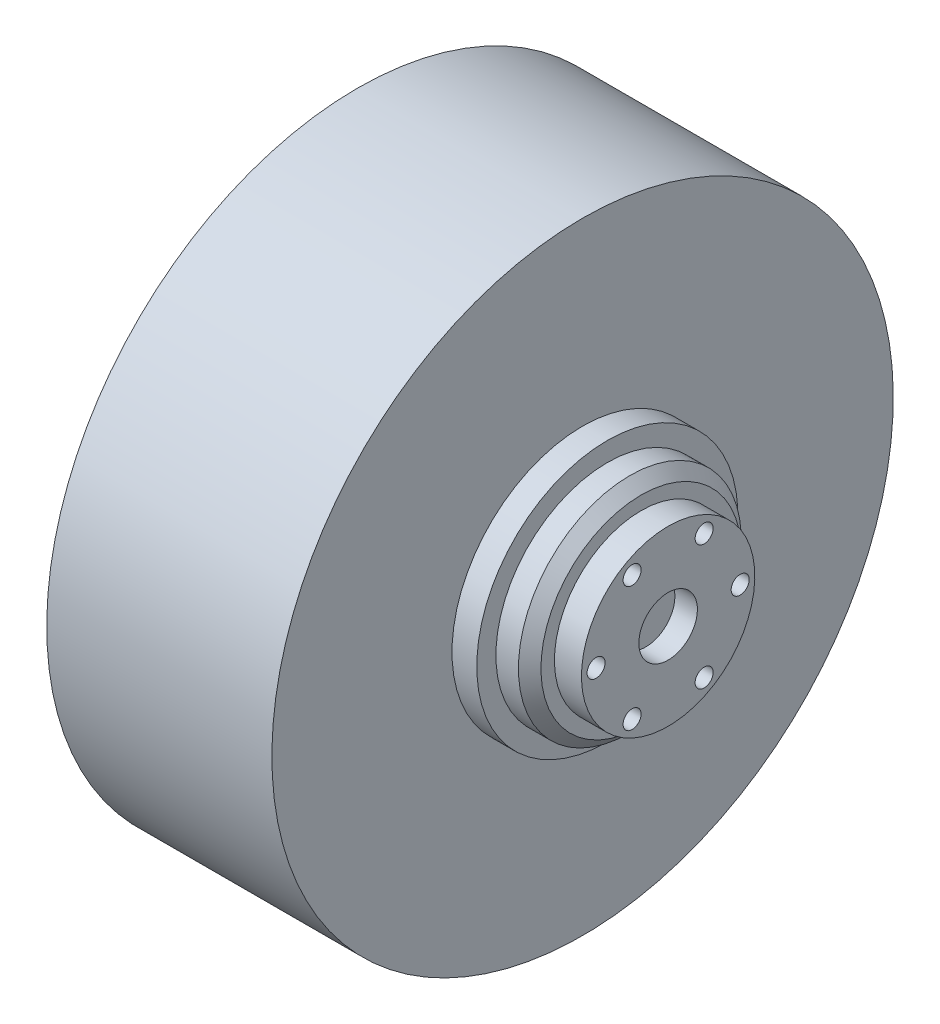
ISO-10303-21;
HEADER;
FILE_DESCRIPTION(('STEP AP214'),'2;1');
FILE_NAME('part.step','',(''),(''),'','','');
FILE_SCHEMA(('AUTOMOTIVE_DESIGN { 1 0 10303 214 1 1 1 1 }'));
ENDSEC;
DATA;
#1=APPLICATION_CONTEXT('core data for automotive mechanical design processes');
#2=APPLICATION_PROTOCOL_DEFINITION('international standard','automotive_design',2000,#1);
#3=PRODUCT_CONTEXT('',#1,'mechanical');
#4=PRODUCT('Part','Part','',(#3));
#5=PRODUCT_RELATED_PRODUCT_CATEGORY('part','',(#4));
#6=PRODUCT_DEFINITION_FORMATION('','',#4);
#7=PRODUCT_DEFINITION_CONTEXT('part definition',#1,'design');
#8=PRODUCT_DEFINITION('design','',#6,#7);
#9=PRODUCT_DEFINITION_SHAPE('','',#8);
#10=(LENGTH_UNIT() NAMED_UNIT(*) SI_UNIT(.MILLI.,.METRE.));
#11=(NAMED_UNIT(*) PLANE_ANGLE_UNIT() SI_UNIT($,.RADIAN.));
#12=(NAMED_UNIT(*) SI_UNIT($,.STERADIAN.) SOLID_ANGLE_UNIT());
#13=UNCERTAINTY_MEASURE_WITH_UNIT(LENGTH_MEASURE(1.E-05),#10,'distance_accuracy_value','');
#14=(GEOMETRIC_REPRESENTATION_CONTEXT(3) GLOBAL_UNCERTAINTY_ASSIGNED_CONTEXT((#13)) GLOBAL_UNIT_ASSIGNED_CONTEXT((#10,
#11,#12)) REPRESENTATION_CONTEXT('',''));
#15=CARTESIAN_POINT('',(0.,0.,0.));
#16=DIRECTION('',(0.,0.,1.));
#17=DIRECTION('',(1.,0.,0.));
#18=AXIS2_PLACEMENT_3D('',#15,#16,#17);
#19=CARTESIAN_POINT('',(-90.,0.,0.));
#20=DIRECTION('',(1.,0.,0.));
#21=DIRECTION('',(0.,1.,0.));
#22=AXIS2_PLACEMENT_3D('',#19,#20,#21);
#23=PLANE('',#22);
#24=CARTESIAN_POINT('',(-90.,0.,0.));
#25=DIRECTION('',(1.,0.,0.));
#26=DIRECTION('',(0.,1.,0.));
#27=AXIS2_PLACEMENT_3D('',#24,#25,#26);
#28=CIRCLE('',#27,36.5);
#29=CARTESIAN_POINT('',(-90.,36.5,0.));
#30=VERTEX_POINT('',#29);
#31=EDGE_CURVE('E10',#30,#30,#28,.T.);
#32=ORIENTED_EDGE('',*,*,#31,.F.);
#33=EDGE_LOOP('',(#32));
#34=FACE_BOUND('',#33,.T.);
#35=ADVANCED_FACE('F43',(#34),#23,.F.);
#36=CARTESIAN_POINT('',(90.,0.,0.));
#37=DIRECTION('',(1.,0.,0.));
#38=DIRECTION('',(0.,1.,0.));
#39=AXIS2_PLACEMENT_3D('',#36,#37,#38);
#40=CYLINDRICAL_SURFACE('',#39,36.5);
#41=CARTESIAN_POINT('',(-70.,0.,0.));
#42=DIRECTION('',(1.,0.,0.));
#43=DIRECTION('',(0.,1.,0.));
#44=AXIS2_PLACEMENT_3D('',#41,#42,#43);
#45=CIRCLE('',#44,36.5);
#46=CARTESIAN_POINT('',(-70.,36.5,0.));
#47=VERTEX_POINT('',#46);
#48=EDGE_CURVE('E50',#47,#47,#45,.T.);
#49=ORIENTED_EDGE('',*,*,#48,.F.);
#50=EDGE_LOOP('',(#49));
#51=FACE_BOUND('',#50,.T.);
#52=ORIENTED_EDGE('',*,*,#31,.T.);
#53=EDGE_LOOP('',(#52));
#54=FACE_BOUND('',#53,.T.);
#55=ADVANCED_FACE('F248',(#51,#54),#40,.T.);
#56=CARTESIAN_POINT('',(-70.,-36.5,0.));
#57=DIRECTION('',(1.,0.,0.));
#58=DIRECTION('',(0.,1.,0.));
#59=AXIS2_PLACEMENT_3D('',#56,#57,#58);
#60=PLANE('',#59);
#61=CARTESIAN_POINT('',(-70.,0.,0.));
#62=DIRECTION('',(1.,0.,0.));
#63=DIRECTION('',(0.,1.,0.));
#64=AXIS2_PLACEMENT_3D('',#61,#62,#63);
#65=CIRCLE('',#64,47.);
#66=CARTESIAN_POINT('',(-70.,47.,0.));
#67=VERTEX_POINT('',#66);
#68=EDGE_CURVE('E57',#67,#67,#65,.T.);
#69=ORIENTED_EDGE('',*,*,#68,.F.);
#70=EDGE_LOOP('',(#69));
#71=FACE_BOUND('',#70,.T.);
#72=ORIENTED_EDGE('',*,*,#48,.T.);
#73=EDGE_LOOP('',(#72));
#74=FACE_BOUND('',#73,.T.);
#75=ADVANCED_FACE('F243',(#71,#74),#60,.F.);
#76=CARTESIAN_POINT('',(90.,0.,0.));
#77=DIRECTION('',(1.,0.,0.));
#78=DIRECTION('',(0.,1.,0.));
#79=AXIS2_PLACEMENT_3D('',#76,#77,#78);
#80=CYLINDRICAL_SURFACE('',#79,47.);
#81=CARTESIAN_POINT('',(-48.,0.,0.));
#82=DIRECTION('',(1.,0.,0.));
#83=DIRECTION('',(0.,1.,0.));
#84=AXIS2_PLACEMENT_3D('',#81,#82,#83);
#85=CIRCLE('',#84,47.);
#86=CARTESIAN_POINT('',(-48.,47.,0.));
#87=VERTEX_POINT('',#86);
#88=EDGE_CURVE('E62',#87,#87,#85,.T.);
#89=ORIENTED_EDGE('',*,*,#88,.F.);
#90=EDGE_LOOP('',(#89));
#91=FACE_BOUND('',#90,.T.);
#92=ORIENTED_EDGE('',*,*,#68,.T.);
#93=EDGE_LOOP('',(#92));
#94=FACE_BOUND('',#93,.T.);
#95=ADVANCED_FACE('F237',(#91,#94),#80,.T.);
#96=CARTESIAN_POINT('',(-48.,-47.,0.));
#97=DIRECTION('',(1.,0.,0.));
#98=DIRECTION('',(0.,1.,0.));
#99=AXIS2_PLACEMENT_3D('',#96,#97,#98);
#100=PLANE('',#99);
#101=CARTESIAN_POINT('',(-48.,0.,0.));
#102=DIRECTION('',(1.,0.,0.));
#103=DIRECTION('',(0.,1.,0.));
#104=AXIS2_PLACEMENT_3D('',#101,#102,#103);
#105=CIRCLE('',#104,138.);
#106=CARTESIAN_POINT('',(-48.,138.,0.));
#107=VERTEX_POINT('',#106);
#108=EDGE_CURVE('E67',#107,#107,#105,.T.);
#109=ORIENTED_EDGE('',*,*,#108,.F.);
#110=EDGE_LOOP('',(#109));
#111=FACE_BOUND('',#110,.T.);
#112=ORIENTED_EDGE('',*,*,#88,.T.);
#113=EDGE_LOOP('',(#112));
#114=FACE_BOUND('',#113,.T.);
#115=ADVANCED_FACE('F231',(#111,#114),#100,.F.);
#116=CARTESIAN_POINT('',(90.,0.,0.));
#117=DIRECTION('',(1.,0.,0.));
#118=DIRECTION('',(0.,1.,0.));
#119=AXIS2_PLACEMENT_3D('',#116,#117,#118);
#120=CYLINDRICAL_SURFACE('',#119,138.);
#121=CARTESIAN_POINT('',(52.,0.,0.));
#122=DIRECTION('',(1.,0.,0.));
#123=DIRECTION('',(0.,1.,0.));
#124=AXIS2_PLACEMENT_3D('',#121,#122,#123);
#125=CIRCLE('',#124,138.);
#126=CARTESIAN_POINT('',(52.,138.,0.));
#127=VERTEX_POINT('',#126);
#128=EDGE_CURVE('E71',#127,#127,#125,.T.);
#129=ORIENTED_EDGE('',*,*,#128,.F.);
#130=EDGE_LOOP('',(#129));
#131=FACE_BOUND('',#130,.T.);
#132=ORIENTED_EDGE('',*,*,#108,.T.);
#133=EDGE_LOOP('',(#132));
#134=FACE_BOUND('',#133,.T.);
#135=ADVANCED_FACE('F225',(#131,#134),#120,.T.);
#136=CARTESIAN_POINT('',(52.,-138.,0.));
#137=DIRECTION('',(-1.,0.,0.));
#138=DIRECTION('',(0.,-1.,0.));
#139=AXIS2_PLACEMENT_3D('',#136,#137,#138);
#140=PLANE('',#139);
#141=CARTESIAN_POINT('',(52.,0.,0.));
#142=DIRECTION('',(1.,0.,0.));
#143=DIRECTION('',(0.,1.,0.));
#144=AXIS2_PLACEMENT_3D('',#141,#142,#143);
#145=CIRCLE('',#144,58.);
#146=CARTESIAN_POINT('',(52.,58.,0.));
#147=VERTEX_POINT('',#146);
#148=EDGE_CURVE('E74',#147,#147,#145,.T.);
#149=ORIENTED_EDGE('',*,*,#148,.F.);
#150=EDGE_LOOP('',(#149));
#151=FACE_BOUND('',#150,.T.);
#152=ORIENTED_EDGE('',*,*,#128,.T.);
#153=EDGE_LOOP('',(#152));
#154=FACE_BOUND('',#153,.T.);
#155=ADVANCED_FACE('F219',(#151,#154),#140,.F.);
#156=CARTESIAN_POINT('',(90.,0.,0.));
#157=DIRECTION('',(1.,0.,0.));
#158=DIRECTION('',(0.,1.,0.));
#159=AXIS2_PLACEMENT_3D('',#156,#157,#158);
#160=CYLINDRICAL_SURFACE('',#159,58.);
#161=CARTESIAN_POINT('',(63.,0.,0.));
#162=DIRECTION('',(1.,0.,0.));
#163=DIRECTION('',(0.,1.,0.));
#164=AXIS2_PLACEMENT_3D('',#161,#162,#163);
#165=CIRCLE('',#164,58.);
#166=CARTESIAN_POINT('',(63.,58.,0.));
#167=VERTEX_POINT('',#166);
#168=EDGE_CURVE('E78',#167,#167,#165,.T.);
#169=ORIENTED_EDGE('',*,*,#168,.F.);
#170=EDGE_LOOP('',(#169));
#171=FACE_BOUND('',#170,.T.);
#172=ORIENTED_EDGE('',*,*,#148,.T.);
#173=EDGE_LOOP('',(#172));
#174=FACE_BOUND('',#173,.T.);
#175=ADVANCED_FACE('F213',(#171,#174),#160,.T.);
#176=CARTESIAN_POINT('',(63.,-58.,0.));
#177=DIRECTION('',(-1.,0.,0.));
#178=DIRECTION('',(0.,-1.,0.));
#179=AXIS2_PLACEMENT_3D('',#176,#177,#178);
#180=PLANE('',#179);
#181=CARTESIAN_POINT('',(63.,0.,0.));
#182=DIRECTION('',(1.,0.,0.));
#183=DIRECTION('',(0.,1.,0.));
#184=AXIS2_PLACEMENT_3D('',#181,#182,#183);
#185=CIRCLE('',#184,49.5);
#186=CARTESIAN_POINT('',(63.,49.5,0.));
#187=VERTEX_POINT('',#186);
#188=EDGE_CURVE('E82',#187,#187,#185,.T.);
#189=ORIENTED_EDGE('',*,*,#188,.F.);
#190=EDGE_LOOP('',(#189));
#191=FACE_BOUND('',#190,.T.);
#192=ORIENTED_EDGE('',*,*,#168,.T.);
#193=EDGE_LOOP('',(#192));
#194=FACE_BOUND('',#193,.T.);
#195=ADVANCED_FACE('F207',(#191,#194),#180,.F.);
#196=CARTESIAN_POINT('',(90.,0.,0.));
#197=DIRECTION('',(1.,0.,0.));
#198=DIRECTION('',(0.,1.,0.));
#199=AXIS2_PLACEMENT_3D('',#196,#197,#198);
#200=CYLINDRICAL_SURFACE('',#199,49.5);
#201=CARTESIAN_POINT('',(73.,0.,0.));
#202=DIRECTION('',(1.,0.,0.));
#203=DIRECTION('',(0.,1.,0.));
#204=AXIS2_PLACEMENT_3D('',#201,#202,#203);
#205=CIRCLE('',#204,49.5);
#206=CARTESIAN_POINT('',(73.,49.5,0.));
#207=VERTEX_POINT('',#206);
#208=EDGE_CURVE('E86',#207,#207,#205,.T.);
#209=ORIENTED_EDGE('',*,*,#208,.F.);
#210=EDGE_LOOP('',(#209));
#211=FACE_BOUND('',#210,.T.);
#212=ORIENTED_EDGE('',*,*,#188,.T.);
#213=EDGE_LOOP('',(#212));
#214=FACE_BOUND('',#213,.T.);
#215=ADVANCED_FACE('F201',(#211,#214),#200,.T.);
#216=CARTESIAN_POINT('',(73.,0.,0.));
#217=DIRECTION('',(-1.,0.,0.));
#218=DIRECTION('',(0.,-1.,0.));
#219=AXIS2_PLACEMENT_3D('',#216,#217,#218);
#220=CONICAL_SURFACE('',#219,49.5,0.785398163397448);
#221=CARTESIAN_POINT('',(78.,0.,0.));
#222=DIRECTION('',(1.,0.,0.));
#223=DIRECTION('',(0.,1.,0.));
#224=AXIS2_PLACEMENT_3D('',#221,#222,#223);
#225=CIRCLE('',#224,44.5);
#226=CARTESIAN_POINT('',(78.,44.5,0.));
#227=VERTEX_POINT('',#226);
#228=EDGE_CURVE('E90',#227,#227,#225,.T.);
#229=ORIENTED_EDGE('',*,*,#228,.F.);
#230=EDGE_LOOP('',(#229));
#231=FACE_BOUND('',#230,.T.);
#232=ORIENTED_EDGE('',*,*,#208,.T.);
#233=EDGE_LOOP('',(#232));
#234=FACE_BOUND('',#233,.T.);
#235=ADVANCED_FACE('F195',(#231,#234),#220,.T.);
#236=CARTESIAN_POINT('',(78.,-44.5,0.));
#237=DIRECTION('',(-1.,0.,0.));
#238=DIRECTION('',(0.,-1.,0.));
#239=AXIS2_PLACEMENT_3D('',#236,#237,#238);
#240=PLANE('',#239);
#241=CARTESIAN_POINT('',(78.,0.,0.));
#242=DIRECTION('',(1.,0.,0.));
#243=DIRECTION('',(0.,1.,0.));
#244=AXIS2_PLACEMENT_3D('',#241,#242,#243);
#245=CIRCLE('',#244,38.5);
#246=CARTESIAN_POINT('',(78.,38.5,0.));
#247=VERTEX_POINT('',#246);
#248=EDGE_CURVE('E94',#247,#247,#245,.T.);
#249=ORIENTED_EDGE('',*,*,#248,.F.);
#250=EDGE_LOOP('',(#249));
#251=FACE_BOUND('',#250,.T.);
#252=ORIENTED_EDGE('',*,*,#228,.T.);
#253=EDGE_LOOP('',(#252));
#254=FACE_BOUND('',#253,.T.);
#255=ADVANCED_FACE('F189',(#251,#254),#240,.F.);
#256=CARTESIAN_POINT('',(90.,0.,0.));
#257=DIRECTION('',(1.,0.,0.));
#258=DIRECTION('',(0.,1.,0.));
#259=AXIS2_PLACEMENT_3D('',#256,#257,#258);
#260=CYLINDRICAL_SURFACE('',#259,38.5);
#261=CARTESIAN_POINT('',(90.,0.,0.));
#262=DIRECTION('',(1.,0.,0.));
#263=DIRECTION('',(0.,1.,0.));
#264=AXIS2_PLACEMENT_3D('',#261,#262,#263);
#265=CIRCLE('',#264,38.5);
#266=CARTESIAN_POINT('',(90.,38.5,0.));
#267=VERTEX_POINT('',#266);
#268=EDGE_CURVE('E98',#267,#267,#265,.T.);
#269=ORIENTED_EDGE('',*,*,#268,.F.);
#270=EDGE_LOOP('',(#269));
#271=FACE_BOUND('',#270,.T.);
#272=ORIENTED_EDGE('',*,*,#248,.T.);
#273=EDGE_LOOP('',(#272));
#274=FACE_BOUND('',#273,.T.);
#275=ADVANCED_FACE('F171',(#271,#274),#260,.T.);
#276=CARTESIAN_POINT('',(90.,-38.5,0.));
#277=DIRECTION('',(-1.,0.,0.));
#278=DIRECTION('',(0.,-1.,0.));
#279=AXIS2_PLACEMENT_3D('',#276,#277,#278);
#280=PLANE('',#279);
#281=CARTESIAN_POINT('',(90.,0.,0.));
#282=DIRECTION('',(1.,0.,0.));
#283=DIRECTION('',(0.,1.,0.));
#284=AXIS2_PLACEMENT_3D('',#281,#282,#283);
#285=CIRCLE('',#284,13.);
#286=CARTESIAN_POINT('',(90.,13.,0.));
#287=VERTEX_POINT('',#286);
#288=EDGE_CURVE('E150',#287,#287,#285,.T.);
#289=ORIENTED_EDGE('',*,*,#288,.F.);
#290=EDGE_LOOP('',(#289));
#291=FACE_BOUND('',#290,.T.);
#292=CARTESIAN_POINT('',(90.,27.712812921102,16.));
#293=DIRECTION('',(1.,0.,0.));
#294=DIRECTION('',(0.,1.,0.));
#295=AXIS2_PLACEMENT_3D('',#292,#293,#294);
#296=CIRCLE('',#295,4.);
#297=CARTESIAN_POINT('',(90.,31.712812921102,16.));
#298=VERTEX_POINT('',#297);
#299=EDGE_CURVE('E111',#298,#298,#296,.T.);
#300=ORIENTED_EDGE('',*,*,#299,.F.);
#301=EDGE_LOOP('',(#300));
#302=FACE_BOUND('',#301,.T.);
#303=CARTESIAN_POINT('',(90.,0.,32.));
#304=DIRECTION('',(1.,0.,0.));
#305=DIRECTION('',(0.,1.,0.));
#306=AXIS2_PLACEMENT_3D('',#303,#304,#305);
#307=CIRCLE('',#306,4.);
#308=CARTESIAN_POINT('',(90.,4.00000000000002,32.));
#309=VERTEX_POINT('',#308);
#310=EDGE_CURVE('E120',#309,#309,#307,.T.);
#311=ORIENTED_EDGE('',*,*,#310,.F.);
#312=EDGE_LOOP('',(#311));
#313=FACE_BOUND('',#312,.T.);
#314=CARTESIAN_POINT('',(90.,-27.712812921102,16.));
#315=DIRECTION('',(1.,0.,0.));
#316=DIRECTION('',(0.,1.,0.));
#317=AXIS2_PLACEMENT_3D('',#314,#315,#316);
#318=CIRCLE('',#317,4.);
#319=CARTESIAN_POINT('',(90.,-23.712812921102,16.));
#320=VERTEX_POINT('',#319);
#321=EDGE_CURVE('E128',#320,#320,#318,.T.);
#322=ORIENTED_EDGE('',*,*,#321,.F.);
#323=EDGE_LOOP('',(#322));
#324=FACE_BOUND('',#323,.T.);
#325=CARTESIAN_POINT('',(90.,-27.712812921102,-16.));
#326=DIRECTION('',(1.,0.,0.));
#327=DIRECTION('',(0.,1.,0.));
#328=AXIS2_PLACEMENT_3D('',#325,#326,#327);
#329=CIRCLE('',#328,4.);
#330=CARTESIAN_POINT('',(90.,-23.712812921102,-16.));
#331=VERTEX_POINT('',#330);
#332=EDGE_CURVE('E136',#331,#331,#329,.T.);
#333=ORIENTED_EDGE('',*,*,#332,.F.);
#334=EDGE_LOOP('',(#333));
#335=FACE_BOUND('',#334,.T.);
#336=CARTESIAN_POINT('',(90.,0.,-32.));
#337=DIRECTION('',(1.,0.,0.));
#338=DIRECTION('',(0.,1.,0.));
#339=AXIS2_PLACEMENT_3D('',#336,#337,#338);
#340=CIRCLE('',#339,4.);
#341=CARTESIAN_POINT('',(90.,4.00000000000001,-32.));
#342=VERTEX_POINT('',#341);
#343=EDGE_CURVE('E143',#342,#342,#340,.T.);
#344=ORIENTED_EDGE('',*,*,#343,.F.);
#345=EDGE_LOOP('',(#344));
#346=FACE_BOUND('',#345,.T.);
#347=CARTESIAN_POINT('',(90.,27.712812921102,-16.));
#348=DIRECTION('',(1.,0.,0.));
#349=DIRECTION('',(0.,1.,0.));
#350=AXIS2_PLACEMENT_3D('',#347,#348,#349);
#351=CIRCLE('',#350,4.);
#352=CARTESIAN_POINT('',(90.,31.712812921102,-16.));
#353=VERTEX_POINT('',#352);
#354=EDGE_CURVE('E103',#353,#353,#351,.T.);
#355=ORIENTED_EDGE('',*,*,#354,.F.);
#356=EDGE_LOOP('',(#355));
#357=FACE_BOUND('',#356,.T.);
#358=ORIENTED_EDGE('',*,*,#268,.T.);
#359=EDGE_LOOP('',(#358));
#360=FACE_BOUND('',#359,.T.);
#361=ADVANCED_FACE('F167',(#291,#302,#313,#324,#335,#346,#357,#360),#280,.F.);
#362=CARTESIAN_POINT('',(80.,27.712812921102,-16.));
#363=DIRECTION('',(1.,0.,0.));
#364=DIRECTION('',(0.,1.,0.));
#365=AXIS2_PLACEMENT_3D('',#362,#363,#364);
#366=CYLINDRICAL_SURFACE('',#365,4.);
#367=CARTESIAN_POINT('',(80.,27.712812921102,-16.));
#368=DIRECTION('',(1.,0.,0.));
#369=DIRECTION('',(0.,1.,0.));
#370=AXIS2_PLACEMENT_3D('',#367,#368,#369);
#371=CIRCLE('',#370,4.);
#372=CARTESIAN_POINT('',(80.,31.712812921102,-16.));
#373=VERTEX_POINT('',#372);
#374=EDGE_CURVE('E102',#373,#373,#371,.T.);
#375=ORIENTED_EDGE('',*,*,#374,.F.);
#376=EDGE_LOOP('',(#375));
#377=FACE_BOUND('',#376,.T.);
#378=ORIENTED_EDGE('',*,*,#354,.T.);
#379=EDGE_LOOP('',(#378));
#380=FACE_BOUND('',#379,.T.);
#381=ADVANCED_FACE('F170',(#377,#380),#366,.F.);
#382=CARTESIAN_POINT('',(80.,27.712812921102,-16.));
#383=DIRECTION('',(1.,0.,0.));
#384=DIRECTION('',(0.,1.,0.));
#385=AXIS2_PLACEMENT_3D('',#382,#383,#384);
#386=PLANE('',#385);
#387=ORIENTED_EDGE('',*,*,#374,.T.);
#388=EDGE_LOOP('',(#387));
#389=FACE_BOUND('',#388,.T.);
#390=ADVANCED_FACE('F300',(#389),#386,.T.);
#391=CARTESIAN_POINT('',(80.,0.,-32.));
#392=DIRECTION('',(1.,0.,0.));
#393=DIRECTION('',(0.,1.,0.));
#394=AXIS2_PLACEMENT_3D('',#391,#392,#393);
#395=CYLINDRICAL_SURFACE('',#394,4.);
#396=CARTESIAN_POINT('',(80.,0.,-32.));
#397=DIRECTION('',(1.,0.,0.));
#398=DIRECTION('',(0.,1.,0.));
#399=AXIS2_PLACEMENT_3D('',#396,#397,#398);
#400=CIRCLE('',#399,4.);
#401=CARTESIAN_POINT('',(80.,4.00000000000001,-32.));
#402=VERTEX_POINT('',#401);
#403=EDGE_CURVE('E107',#402,#402,#400,.T.);
#404=ORIENTED_EDGE('',*,*,#403,.F.);
#405=EDGE_LOOP('',(#404));
#406=FACE_BOUND('',#405,.T.);
#407=ORIENTED_EDGE('',*,*,#343,.T.);
#408=EDGE_LOOP('',(#407));
#409=FACE_BOUND('',#408,.T.);
#410=ADVANCED_FACE('F381',(#406,#409),#395,.F.);
#411=CARTESIAN_POINT('',(80.,0.,-32.));
#412=DIRECTION('',(1.,0.,0.));
#413=DIRECTION('',(0.,1.,0.));
#414=AXIS2_PLACEMENT_3D('',#411,#412,#413);
#415=PLANE('',#414);
#416=ORIENTED_EDGE('',*,*,#403,.T.);
#417=EDGE_LOOP('',(#416));
#418=FACE_BOUND('',#417,.T.);
#419=ADVANCED_FACE('F390',(#418),#415,.T.);
#420=CARTESIAN_POINT('',(80.,-27.712812921102,-16.));
#421=DIRECTION('',(1.,0.,0.));
#422=DIRECTION('',(0.,1.,0.));
#423=AXIS2_PLACEMENT_3D('',#420,#421,#422);
#424=CYLINDRICAL_SURFACE('',#423,4.);
#425=CARTESIAN_POINT('',(80.,-27.712812921102,-16.));
#426=DIRECTION('',(1.,0.,0.));
#427=DIRECTION('',(0.,1.,0.));
#428=AXIS2_PLACEMENT_3D('',#425,#426,#427);
#429=CIRCLE('',#428,4.);
#430=CARTESIAN_POINT('',(80.,-23.712812921102,-16.));
#431=VERTEX_POINT('',#430);
#432=EDGE_CURVE('E139',#431,#431,#429,.T.);
#433=ORIENTED_EDGE('',*,*,#432,.F.);
#434=EDGE_LOOP('',(#433));
#435=FACE_BOUND('',#434,.T.);
#436=ORIENTED_EDGE('',*,*,#332,.T.);
#437=EDGE_LOOP('',(#436));
#438=FACE_BOUND('',#437,.T.);
#439=ADVANCED_FACE('F399',(#435,#438),#424,.F.);
#440=CARTESIAN_POINT('',(80.,-27.712812921102,-16.));
#441=DIRECTION('',(1.,0.,0.));
#442=DIRECTION('',(0.,1.,0.));
#443=AXIS2_PLACEMENT_3D('',#440,#441,#442);
#444=PLANE('',#443);
#445=ORIENTED_EDGE('',*,*,#432,.T.);
#446=EDGE_LOOP('',(#445));
#447=FACE_BOUND('',#446,.T.);
#448=ADVANCED_FACE('F325',(#447),#444,.T.);
#449=CARTESIAN_POINT('',(80.,-27.712812921102,16.));
#450=DIRECTION('',(1.,0.,0.));
#451=DIRECTION('',(0.,1.,0.));
#452=AXIS2_PLACEMENT_3D('',#449,#450,#451);
#453=CYLINDRICAL_SURFACE('',#452,4.);
#454=CARTESIAN_POINT('',(80.,-27.712812921102,16.));
#455=DIRECTION('',(1.,0.,0.));
#456=DIRECTION('',(0.,1.,0.));
#457=AXIS2_PLACEMENT_3D('',#454,#455,#456);
#458=CIRCLE('',#457,4.);
#459=CARTESIAN_POINT('',(80.,-23.712812921102,16.));
#460=VERTEX_POINT('',#459);
#461=EDGE_CURVE('E132',#460,#460,#458,.T.);
#462=ORIENTED_EDGE('',*,*,#461,.F.);
#463=EDGE_LOOP('',(#462));
#464=FACE_BOUND('',#463,.T.);
#465=ORIENTED_EDGE('',*,*,#321,.T.);
#466=EDGE_LOOP('',(#465));
#467=FACE_BOUND('',#466,.T.);
#468=ADVANCED_FACE('F320',(#464,#467),#453,.F.);
#469=CARTESIAN_POINT('',(80.,-27.712812921102,16.));
#470=DIRECTION('',(1.,0.,0.));
#471=DIRECTION('',(0.,1.,0.));
#472=AXIS2_PLACEMENT_3D('',#469,#470,#471);
#473=PLANE('',#472);
#474=ORIENTED_EDGE('',*,*,#461,.T.);
#475=EDGE_LOOP('',(#474));
#476=FACE_BOUND('',#475,.T.);
#477=ADVANCED_FACE('F324',(#476),#473,.T.);
#478=CARTESIAN_POINT('',(80.,0.,32.));
#479=DIRECTION('',(1.,0.,0.));
#480=DIRECTION('',(0.,1.,0.));
#481=AXIS2_PLACEMENT_3D('',#478,#479,#480);
#482=CYLINDRICAL_SURFACE('',#481,4.);
#483=CARTESIAN_POINT('',(80.,0.,32.));
#484=DIRECTION('',(1.,0.,0.));
#485=DIRECTION('',(0.,1.,0.));
#486=AXIS2_PLACEMENT_3D('',#483,#484,#485);
#487=CIRCLE('',#486,4.);
#488=CARTESIAN_POINT('',(80.,4.00000000000001,32.));
#489=VERTEX_POINT('',#488);
#490=EDGE_CURVE('E124',#489,#489,#487,.T.);
#491=ORIENTED_EDGE('',*,*,#490,.F.);
#492=EDGE_LOOP('',(#491));
#493=FACE_BOUND('',#492,.T.);
#494=ORIENTED_EDGE('',*,*,#310,.T.);
#495=EDGE_LOOP('',(#494));
#496=FACE_BOUND('',#495,.T.);
#497=ADVANCED_FACE('F422',(#493,#496),#482,.F.);
#498=CARTESIAN_POINT('',(80.,0.,32.));
#499=DIRECTION('',(1.,0.,0.));
#500=DIRECTION('',(0.,1.,0.));
#501=AXIS2_PLACEMENT_3D('',#498,#499,#500);
#502=PLANE('',#501);
#503=ORIENTED_EDGE('',*,*,#490,.T.);
#504=EDGE_LOOP('',(#503));
#505=FACE_BOUND('',#504,.T.);
#506=ADVANCED_FACE('F431',(#505),#502,.T.);
#507=CARTESIAN_POINT('',(80.,27.712812921102,16.));
#508=DIRECTION('',(1.,0.,0.));
#509=DIRECTION('',(0.,1.,0.));
#510=AXIS2_PLACEMENT_3D('',#507,#508,#509);
#511=CYLINDRICAL_SURFACE('',#510,4.);
#512=CARTESIAN_POINT('',(80.,27.712812921102,16.));
#513=DIRECTION('',(1.,0.,0.));
#514=DIRECTION('',(0.,1.,0.));
#515=AXIS2_PLACEMENT_3D('',#512,#513,#514);
#516=CIRCLE('',#515,4.);
#517=CARTESIAN_POINT('',(80.,31.712812921102,16.));
#518=VERTEX_POINT('',#517);
#519=EDGE_CURVE('E115',#518,#518,#516,.T.);
#520=ORIENTED_EDGE('',*,*,#519,.F.);
#521=EDGE_LOOP('',(#520));
#522=FACE_BOUND('',#521,.T.);
#523=ORIENTED_EDGE('',*,*,#299,.T.);
#524=EDGE_LOOP('',(#523));
#525=FACE_BOUND('',#524,.T.);
#526=ADVANCED_FACE('F440',(#522,#525),#511,.F.);
#527=CARTESIAN_POINT('',(80.,27.712812921102,16.));
#528=DIRECTION('',(1.,0.,0.));
#529=DIRECTION('',(0.,1.,0.));
#530=AXIS2_PLACEMENT_3D('',#527,#528,#529);
#531=PLANE('',#530);
#532=ORIENTED_EDGE('',*,*,#519,.T.);
#533=EDGE_LOOP('',(#532));
#534=FACE_BOUND('',#533,.T.);
#535=ADVANCED_FACE('F163',(#534),#531,.T.);
#536=CARTESIAN_POINT('',(80.,0.,0.));
#537=DIRECTION('',(1.,0.,0.));
#538=DIRECTION('',(0.,1.,0.));
#539=AXIS2_PLACEMENT_3D('',#536,#537,#538);
#540=CYLINDRICAL_SURFACE('',#539,13.);
#541=CARTESIAN_POINT('',(80.,0.,0.));
#542=DIRECTION('',(1.,0.,0.));
#543=DIRECTION('',(0.,1.,0.));
#544=AXIS2_PLACEMENT_3D('',#541,#542,#543);
#545=CIRCLE('',#544,13.);
#546=CARTESIAN_POINT('',(80.,13.,0.));
#547=VERTEX_POINT('',#546);
#548=EDGE_CURVE('E116',#547,#547,#545,.T.);
#549=ORIENTED_EDGE('',*,*,#548,.F.);
#550=EDGE_LOOP('',(#549));
#551=FACE_BOUND('',#550,.T.);
#552=ORIENTED_EDGE('',*,*,#288,.T.);
#553=EDGE_LOOP('',(#552));
#554=FACE_BOUND('',#553,.T.);
#555=ADVANCED_FACE('F160',(#551,#554),#540,.F.);
#556=CARTESIAN_POINT('',(80.,0.,0.));
#557=DIRECTION('',(1.,0.,0.));
#558=DIRECTION('',(0.,1.,0.));
#559=AXIS2_PLACEMENT_3D('',#556,#557,#558);
#560=PLANE('',#559);
#561=ORIENTED_EDGE('',*,*,#548,.T.);
#562=EDGE_LOOP('',(#561));
#563=FACE_BOUND('',#562,.T.);
#564=ADVANCED_FACE('F158',(#563),#560,.T.);
#565=CLOSED_SHELL('',(#35,#55,#75,#95,#115,#135,#155,#175,#195,#215,#235,#255,#275,#361,#381,
#390,#410,#419,#439,#448,#468,#477,#497,#506,#526,#535,#555,#564));
#566=MANIFOLD_SOLID_BREP('B2',#565);
#567=ADVANCED_BREP_SHAPE_REPRESENTATION('',(#18,#566),#14);
#568=SHAPE_DEFINITION_REPRESENTATION(#9,#567);
ENDSEC;
END-ISO-10303-21;
